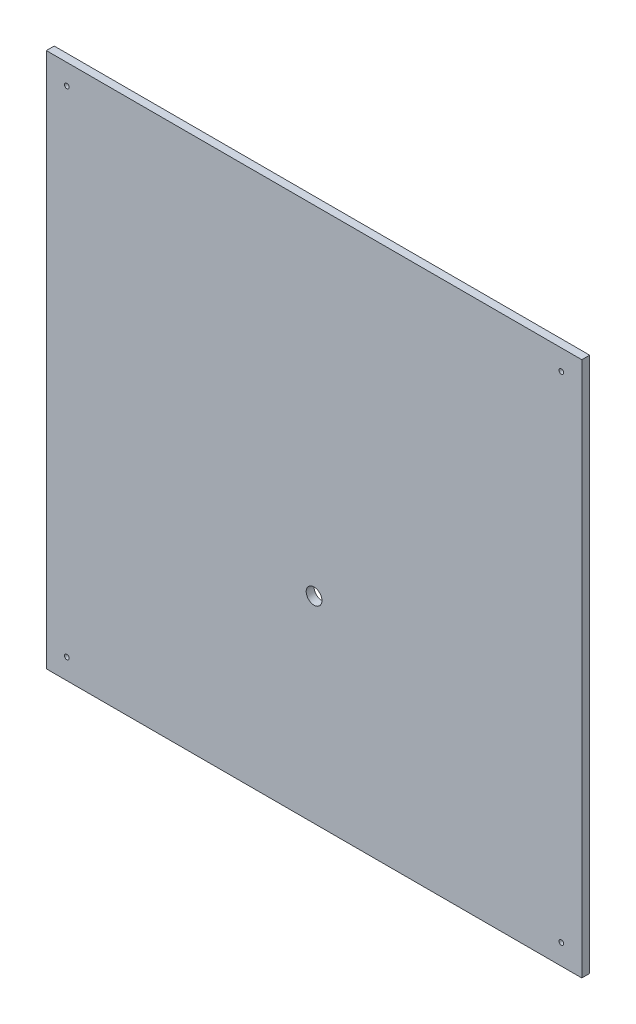
ISO-10303-21;
HEADER;
FILE_DESCRIPTION(('STEP AP214'),'2;1');
FILE_NAME('part.step','',(''),(''),'','','');
FILE_SCHEMA(('AUTOMOTIVE_DESIGN { 1 0 10303 214 1 1 1 1 }'));
ENDSEC;
DATA;
#1=APPLICATION_CONTEXT('core data for automotive mechanical design processes');
#2=APPLICATION_PROTOCOL_DEFINITION('international standard','automotive_design',2000,#1);
#3=PRODUCT_CONTEXT('',#1,'mechanical');
#4=PRODUCT('Part','Part','',(#3));
#5=PRODUCT_RELATED_PRODUCT_CATEGORY('part','',(#4));
#6=PRODUCT_DEFINITION_FORMATION('','',#4);
#7=PRODUCT_DEFINITION_CONTEXT('part definition',#1,'design');
#8=PRODUCT_DEFINITION('design','',#6,#7);
#9=PRODUCT_DEFINITION_SHAPE('','',#8);
#10=(LENGTH_UNIT() NAMED_UNIT(*) SI_UNIT(.MILLI.,.METRE.));
#11=(NAMED_UNIT(*) PLANE_ANGLE_UNIT() SI_UNIT($,.RADIAN.));
#12=(NAMED_UNIT(*) SI_UNIT($,.STERADIAN.) SOLID_ANGLE_UNIT());
#13=UNCERTAINTY_MEASURE_WITH_UNIT(LENGTH_MEASURE(1.E-05),#10,'distance_accuracy_value','');
#14=(GEOMETRIC_REPRESENTATION_CONTEXT(3) GLOBAL_UNCERTAINTY_ASSIGNED_CONTEXT((#13)) GLOBAL_UNIT_ASSIGNED_CONTEXT((#10,
#11,#12)) REPRESENTATION_CONTEXT('',''));
#15=CARTESIAN_POINT('',(0.,0.,0.));
#16=DIRECTION('',(0.,0.,1.));
#17=DIRECTION('',(1.,0.,0.));
#18=AXIS2_PLACEMENT_3D('',#15,#16,#17);
#19=CARTESIAN_POINT('',(0.,0.,5.));
#20=DIRECTION('',(0.,0.,1.));
#21=DIRECTION('',(1.,0.,0.));
#22=AXIS2_PLACEMENT_3D('',#19,#20,#21);
#23=PLANE('',#22);
#24=CARTESIAN_POINT('',(265.94719541036,36.5360255420485,5.));
#25=DIRECTION('',(0.,0.,1.));
#26=DIRECTION('',(1.,0.,0.));
#27=AXIS2_PLACEMENT_3D('',#24,#25,#26);
#28=CIRCLE('',#27,1.50000000000002);
#29=CARTESIAN_POINT('',(267.44719541036,36.5360255420485,5.));
#30=VERTEX_POINT('',#29);
#31=EDGE_CURVE('E127',#30,#30,#28,.T.);
#32=ORIENTED_EDGE('',*,*,#31,.F.);
#33=EDGE_LOOP('',(#32));
#34=FACE_BOUND('',#33,.T.);
#35=CARTESIAN_POINT('',(-48.0528045896396,36.5360255420485,5.));
#36=DIRECTION('',(0.,0.,1.));
#37=DIRECTION('',(1.,0.,0.));
#38=AXIS2_PLACEMENT_3D('',#35,#36,#37);
#39=CIRCLE('',#38,1.5);
#40=CARTESIAN_POINT('',(-46.5528045896396,36.5360255420485,5.));
#41=VERTEX_POINT('',#40);
#42=EDGE_CURVE('E115',#41,#41,#39,.T.);
#43=ORIENTED_EDGE('',*,*,#42,.F.);
#44=EDGE_LOOP('',(#43));
#45=FACE_BOUND('',#44,.T.);
#46=DIRECTION('',(0.,-1.,0.));
#47=VECTOR('',#46,1.);
#48=CARTESIAN_POINT('',(-61.0528045896396,49.5360255420485,5.));
#49=LINE('',#48,#47);
#50=CARTESIAN_POINT('',(-61.0528045896396,49.5360255420485,5.));
#51=VERTEX_POINT('',#50);
#52=CARTESIAN_POINT('',(-61.0528045896396,-290.463974457952,5.));
#53=VERTEX_POINT('',#52);
#54=EDGE_CURVE('E85',#51,#53,#49,.T.);
#55=ORIENTED_EDGE('',*,*,#54,.T.);
#56=DIRECTION('',(1.,0.,0.));
#57=VECTOR('',#56,1.);
#58=CARTESIAN_POINT('',(-61.0528045896396,-290.463974457952,5.));
#59=LINE('',#58,#57);
#60=CARTESIAN_POINT('',(278.94719541036,-290.463974457952,5.));
#61=VERTEX_POINT('',#60);
#62=EDGE_CURVE('E80',#53,#61,#59,.T.);
#63=ORIENTED_EDGE('',*,*,#62,.T.);
#64=DIRECTION('',(0.,1.,0.));
#65=VECTOR('',#64,1.);
#66=CARTESIAN_POINT('',(278.94719541036,49.5360255420485,5.));
#67=LINE('',#66,#65);
#68=CARTESIAN_POINT('',(278.94719541036,49.5360255420485,5.));
#69=VERTEX_POINT('',#68);
#70=EDGE_CURVE('E83',#61,#69,#67,.T.);
#71=ORIENTED_EDGE('',*,*,#70,.T.);
#72=DIRECTION('',(-1.,0.,0.));
#73=VECTOR('',#72,1.);
#74=CARTESIAN_POINT('',(-61.0528045896396,49.5360255420485,5.));
#75=LINE('',#74,#73);
#76=EDGE_CURVE('E50',#69,#51,#75,.T.);
#77=ORIENTED_EDGE('',*,*,#76,.T.);
#78=EDGE_LOOP('',(#55,#63,#71,#77));
#79=FACE_BOUND('',#78,.T.);
#80=CARTESIAN_POINT('',(-48.0528045896396,-277.463974457952,5.));
#81=DIRECTION('',(0.,0.,1.));
#82=DIRECTION('',(1.,0.,0.));
#83=AXIS2_PLACEMENT_3D('',#80,#81,#82);
#84=CIRCLE('',#83,1.5);
#85=CARTESIAN_POINT('',(-46.5528045896396,-277.463974457952,5.));
#86=VERTEX_POINT('',#85);
#87=EDGE_CURVE('E100',#86,#86,#84,.T.);
#88=ORIENTED_EDGE('',*,*,#87,.F.);
#89=EDGE_LOOP('',(#88));
#90=FACE_BOUND('',#89,.T.);
#91=CARTESIAN_POINT('',(265.94719541036,-277.463974457952,5.));
#92=DIRECTION('',(0.,0.,1.));
#93=DIRECTION('',(1.,0.,0.));
#94=AXIS2_PLACEMENT_3D('',#91,#92,#93);
#95=CIRCLE('',#94,1.50000000000002);
#96=CARTESIAN_POINT('',(267.44719541036,-277.463974457952,5.));
#97=VERTEX_POINT('',#96);
#98=EDGE_CURVE('E121',#97,#97,#95,.T.);
#99=ORIENTED_EDGE('',*,*,#98,.F.);
#100=EDGE_LOOP('',(#99));
#101=FACE_BOUND('',#100,.T.);
#102=CARTESIAN_POINT('',(108.94719541036,-165.463974457952,5.));
#103=DIRECTION('',(0.,0.,1.));
#104=DIRECTION('',(1.,0.,0.));
#105=AXIS2_PLACEMENT_3D('',#102,#103,#104);
#106=CIRCLE('',#105,4.99999999999999);
#107=CARTESIAN_POINT('',(113.94719541036,-165.463974457952,5.));
#108=VERTEX_POINT('',#107);
#109=EDGE_CURVE('E133',#108,#108,#106,.T.);
#110=ORIENTED_EDGE('',*,*,#109,.F.);
#111=EDGE_LOOP('',(#110));
#112=FACE_BOUND('',#111,.T.);
#113=ADVANCED_FACE('F33',(#34,#45,#79,#90,#101,#112),#23,.T.);
#114=CARTESIAN_POINT('',(0.,0.,0.));
#115=DIRECTION('',(0.,0.,1.));
#116=DIRECTION('',(1.,0.,0.));
#117=AXIS2_PLACEMENT_3D('',#114,#115,#116);
#118=PLANE('',#117);
#119=DIRECTION('',(0.,-1.,0.));
#120=VECTOR('',#119,1.);
#121=CARTESIAN_POINT('',(-61.0528045896396,49.5360255420485,0.));
#122=LINE('',#121,#120);
#123=CARTESIAN_POINT('',(-61.0528045896396,49.5360255420485,0.));
#124=VERTEX_POINT('',#123);
#125=CARTESIAN_POINT('',(-61.0528045896396,-290.463974457952,0.));
#126=VERTEX_POINT('',#125);
#127=EDGE_CURVE('E97',#124,#126,#122,.T.);
#128=ORIENTED_EDGE('',*,*,#127,.F.);
#129=DIRECTION('',(-1.,0.,0.));
#130=VECTOR('',#129,1.);
#131=CARTESIAN_POINT('',(-61.0528045896396,49.5360255420485,0.));
#132=LINE('',#131,#130);
#133=CARTESIAN_POINT('',(278.94719541036,49.5360255420485,0.));
#134=VERTEX_POINT('',#133);
#135=EDGE_CURVE('E73',#134,#124,#132,.T.);
#136=ORIENTED_EDGE('',*,*,#135,.F.);
#137=DIRECTION('',(0.,1.,0.));
#138=VECTOR('',#137,1.);
#139=CARTESIAN_POINT('',(278.94719541036,49.5360255420485,0.));
#140=LINE('',#139,#138);
#141=CARTESIAN_POINT('',(278.94719541036,-290.463974457952,0.));
#142=VERTEX_POINT('',#141);
#143=EDGE_CURVE('E67',#142,#134,#140,.T.);
#144=ORIENTED_EDGE('',*,*,#143,.F.);
#145=DIRECTION('',(1.,0.,0.));
#146=VECTOR('',#145,1.);
#147=CARTESIAN_POINT('',(-61.0528045896396,-290.463974457952,0.));
#148=LINE('',#147,#146);
#149=EDGE_CURVE('E89',#126,#142,#148,.T.);
#150=ORIENTED_EDGE('',*,*,#149,.F.);
#151=EDGE_LOOP('',(#128,#136,#144,#150));
#152=FACE_BOUND('',#151,.T.);
#153=CARTESIAN_POINT('',(-48.0528045896396,-277.463974457952,0.));
#154=DIRECTION('',(0.,0.,1.));
#155=DIRECTION('',(1.,0.,0.));
#156=AXIS2_PLACEMENT_3D('',#153,#154,#155);
#157=CIRCLE('',#156,1.5);
#158=CARTESIAN_POINT('',(-46.5528045896396,-277.463974457952,0.));
#159=VERTEX_POINT('',#158);
#160=EDGE_CURVE('E112',#159,#159,#157,.T.);
#161=ORIENTED_EDGE('',*,*,#160,.T.);
#162=EDGE_LOOP('',(#161));
#163=FACE_BOUND('',#162,.T.);
#164=CARTESIAN_POINT('',(-48.0528045896396,36.5360255420485,0.));
#165=DIRECTION('',(0.,0.,1.));
#166=DIRECTION('',(1.,0.,0.));
#167=AXIS2_PLACEMENT_3D('',#164,#165,#166);
#168=CIRCLE('',#167,1.5);
#169=CARTESIAN_POINT('',(-46.5528045896396,36.5360255420485,0.));
#170=VERTEX_POINT('',#169);
#171=EDGE_CURVE('E118',#170,#170,#168,.T.);
#172=ORIENTED_EDGE('',*,*,#171,.T.);
#173=EDGE_LOOP('',(#172));
#174=FACE_BOUND('',#173,.T.);
#175=CARTESIAN_POINT('',(265.94719541036,-277.463974457952,0.));
#176=DIRECTION('',(0.,0.,1.));
#177=DIRECTION('',(1.,0.,0.));
#178=AXIS2_PLACEMENT_3D('',#175,#176,#177);
#179=CIRCLE('',#178,1.50000000000002);
#180=CARTESIAN_POINT('',(267.44719541036,-277.463974457952,0.));
#181=VERTEX_POINT('',#180);
#182=EDGE_CURVE('E124',#181,#181,#179,.T.);
#183=ORIENTED_EDGE('',*,*,#182,.T.);
#184=EDGE_LOOP('',(#183));
#185=FACE_BOUND('',#184,.T.);
#186=CARTESIAN_POINT('',(265.94719541036,36.5360255420485,0.));
#187=DIRECTION('',(0.,0.,1.));
#188=DIRECTION('',(1.,0.,0.));
#189=AXIS2_PLACEMENT_3D('',#186,#187,#188);
#190=CIRCLE('',#189,1.50000000000002);
#191=CARTESIAN_POINT('',(267.44719541036,36.5360255420485,0.));
#192=VERTEX_POINT('',#191);
#193=EDGE_CURVE('E130',#192,#192,#190,.T.);
#194=ORIENTED_EDGE('',*,*,#193,.T.);
#195=EDGE_LOOP('',(#194));
#196=FACE_BOUND('',#195,.T.);
#197=CARTESIAN_POINT('',(108.94719541036,-165.463974457952,0.));
#198=DIRECTION('',(0.,0.,1.));
#199=DIRECTION('',(1.,0.,0.));
#200=AXIS2_PLACEMENT_3D('',#197,#198,#199);
#201=CIRCLE('',#200,4.99999999999999);
#202=CARTESIAN_POINT('',(113.94719541036,-165.463974457952,0.));
#203=VERTEX_POINT('',#202);
#204=EDGE_CURVE('E136',#203,#203,#201,.T.);
#205=ORIENTED_EDGE('',*,*,#204,.T.);
#206=EDGE_LOOP('',(#205));
#207=FACE_BOUND('',#206,.T.);
#208=ADVANCED_FACE('F108',(#152,#163,#174,#185,#196,#207),#118,.F.);
#209=CARTESIAN_POINT('',(-61.0528045896396,49.5360255420485,5.));
#210=DIRECTION('',(1.,0.,0.));
#211=DIRECTION('',(0.,1.,0.));
#212=AXIS2_PLACEMENT_3D('',#209,#210,#211);
#213=PLANE('',#212);
#214=ORIENTED_EDGE('',*,*,#127,.T.);
#215=DIRECTION('',(0.,0.,-1.));
#216=VECTOR('',#215,1.);
#217=CARTESIAN_POINT('',(-61.0528045896396,-290.463974457952,5.));
#218=LINE('',#217,#216);
#219=EDGE_CURVE('E11',#53,#126,#218,.T.);
#220=ORIENTED_EDGE('',*,*,#219,.F.);
#221=ORIENTED_EDGE('',*,*,#54,.F.);
#222=DIRECTION('',(0.,0.,-1.));
#223=VECTOR('',#222,1.);
#224=CARTESIAN_POINT('',(-61.0528045896396,49.5360255420485,5.));
#225=LINE('',#224,#223);
#226=EDGE_CURVE('E93',#51,#124,#225,.T.);
#227=ORIENTED_EDGE('',*,*,#226,.T.);
#228=EDGE_LOOP('',(#214,#220,#221,#227));
#229=FACE_BOUND('',#228,.T.);
#230=ADVANCED_FACE('F35',(#229),#213,.F.);
#231=CARTESIAN_POINT('',(-61.0528045896396,-290.463974457952,5.));
#232=DIRECTION('',(0.,1.,0.));
#233=DIRECTION('',(0.,0.,1.));
#234=AXIS2_PLACEMENT_3D('',#231,#232,#233);
#235=PLANE('',#234);
#236=ORIENTED_EDGE('',*,*,#149,.T.);
#237=DIRECTION('',(0.,0.,-1.));
#238=VECTOR('',#237,1.);
#239=CARTESIAN_POINT('',(278.94719541036,-290.463974457952,5.));
#240=LINE('',#239,#238);
#241=EDGE_CURVE('E42',#61,#142,#240,.T.);
#242=ORIENTED_EDGE('',*,*,#241,.F.);
#243=ORIENTED_EDGE('',*,*,#62,.F.);
#244=ORIENTED_EDGE('',*,*,#219,.T.);
#245=EDGE_LOOP('',(#236,#242,#243,#244));
#246=FACE_BOUND('',#245,.T.);
#247=ADVANCED_FACE('F88',(#246),#235,.F.);
#248=CARTESIAN_POINT('',(278.94719541036,49.5360255420485,5.));
#249=DIRECTION('',(-1.,0.,0.));
#250=DIRECTION('',(0.,-1.,0.));
#251=AXIS2_PLACEMENT_3D('',#248,#249,#250);
#252=PLANE('',#251);
#253=ORIENTED_EDGE('',*,*,#143,.T.);
#254=DIRECTION('',(0.,0.,-1.));
#255=VECTOR('',#254,1.);
#256=CARTESIAN_POINT('',(278.94719541036,49.5360255420485,5.));
#257=LINE('',#256,#255);
#258=EDGE_CURVE('E90',#69,#134,#257,.T.);
#259=ORIENTED_EDGE('',*,*,#258,.F.);
#260=ORIENTED_EDGE('',*,*,#70,.F.);
#261=ORIENTED_EDGE('',*,*,#241,.T.);
#262=EDGE_LOOP('',(#253,#259,#260,#261));
#263=FACE_BOUND('',#262,.T.);
#264=ADVANCED_FACE('F91',(#263),#252,.F.);
#265=CARTESIAN_POINT('',(-61.0528045896396,49.5360255420485,5.));
#266=DIRECTION('',(0.,-1.,0.));
#267=DIRECTION('',(0.,0.,-1.));
#268=AXIS2_PLACEMENT_3D('',#265,#266,#267);
#269=PLANE('',#268);
#270=ORIENTED_EDGE('',*,*,#135,.T.);
#271=ORIENTED_EDGE('',*,*,#226,.F.);
#272=ORIENTED_EDGE('',*,*,#76,.F.);
#273=ORIENTED_EDGE('',*,*,#258,.T.);
#274=EDGE_LOOP('',(#270,#271,#272,#273));
#275=FACE_BOUND('',#274,.T.);
#276=ADVANCED_FACE('F105',(#275),#269,.F.);
#277=CARTESIAN_POINT('',(-48.0528045896396,-277.463974457952,5.));
#278=DIRECTION('',(0.,0.,-1.));
#279=DIRECTION('',(-1.,0.,0.));
#280=AXIS2_PLACEMENT_3D('',#277,#278,#279);
#281=CYLINDRICAL_SURFACE('',#280,1.5);
#282=ORIENTED_EDGE('',*,*,#87,.T.);
#283=EDGE_LOOP('',(#282));
#284=FACE_BOUND('',#283,.T.);
#285=ORIENTED_EDGE('',*,*,#160,.F.);
#286=EDGE_LOOP('',(#285));
#287=FACE_BOUND('',#286,.T.);
#288=ADVANCED_FACE('F155',(#284,#287),#281,.F.);
#289=CARTESIAN_POINT('',(-48.0528045896396,36.5360255420485,5.));
#290=DIRECTION('',(0.,0.,-1.));
#291=DIRECTION('',(-1.,0.,0.));
#292=AXIS2_PLACEMENT_3D('',#289,#290,#291);
#293=CYLINDRICAL_SURFACE('',#292,1.5);
#294=ORIENTED_EDGE('',*,*,#42,.T.);
#295=EDGE_LOOP('',(#294));
#296=FACE_BOUND('',#295,.T.);
#297=ORIENTED_EDGE('',*,*,#171,.F.);
#298=EDGE_LOOP('',(#297));
#299=FACE_BOUND('',#298,.T.);
#300=ADVANCED_FACE('F201',(#296,#299),#293,.F.);
#301=CARTESIAN_POINT('',(265.94719541036,-277.463974457952,5.));
#302=DIRECTION('',(0.,0.,-1.));
#303=DIRECTION('',(-1.,0.,0.));
#304=AXIS2_PLACEMENT_3D('',#301,#302,#303);
#305=CYLINDRICAL_SURFACE('',#304,1.50000000000002);
#306=ORIENTED_EDGE('',*,*,#98,.T.);
#307=EDGE_LOOP('',(#306));
#308=FACE_BOUND('',#307,.T.);
#309=ORIENTED_EDGE('',*,*,#182,.F.);
#310=EDGE_LOOP('',(#309));
#311=FACE_BOUND('',#310,.T.);
#312=ADVANCED_FACE('F209',(#308,#311),#305,.F.);
#313=CARTESIAN_POINT('',(265.94719541036,36.5360255420485,5.));
#314=DIRECTION('',(0.,0.,-1.));
#315=DIRECTION('',(-1.,0.,0.));
#316=AXIS2_PLACEMENT_3D('',#313,#314,#315);
#317=CYLINDRICAL_SURFACE('',#316,1.50000000000002);
#318=ORIENTED_EDGE('',*,*,#31,.T.);
#319=EDGE_LOOP('',(#318));
#320=FACE_BOUND('',#319,.T.);
#321=ORIENTED_EDGE('',*,*,#193,.F.);
#322=EDGE_LOOP('',(#321));
#323=FACE_BOUND('',#322,.T.);
#324=ADVANCED_FACE('F217',(#320,#323),#317,.F.);
#325=CARTESIAN_POINT('',(108.94719541036,-165.463974457952,5.));
#326=DIRECTION('',(0.,0.,-1.));
#327=DIRECTION('',(-1.,0.,0.));
#328=AXIS2_PLACEMENT_3D('',#325,#326,#327);
#329=CYLINDRICAL_SURFACE('',#328,4.99999999999999);
#330=ORIENTED_EDGE('',*,*,#109,.T.);
#331=EDGE_LOOP('',(#330));
#332=FACE_BOUND('',#331,.T.);
#333=ORIENTED_EDGE('',*,*,#204,.F.);
#334=EDGE_LOOP('',(#333));
#335=FACE_BOUND('',#334,.T.);
#336=ADVANCED_FACE('F142',(#332,#335),#329,.F.);
#337=CLOSED_SHELL('',(#113,#208,#230,#247,#264,#276,#288,#300,#312,#324,#336));
#338=MANIFOLD_SOLID_BREP('B2',#337);
#339=ADVANCED_BREP_SHAPE_REPRESENTATION('',(#18,#338),#14);
#340=SHAPE_DEFINITION_REPRESENTATION(#9,#339);
ENDSEC;
END-ISO-10303-21;
